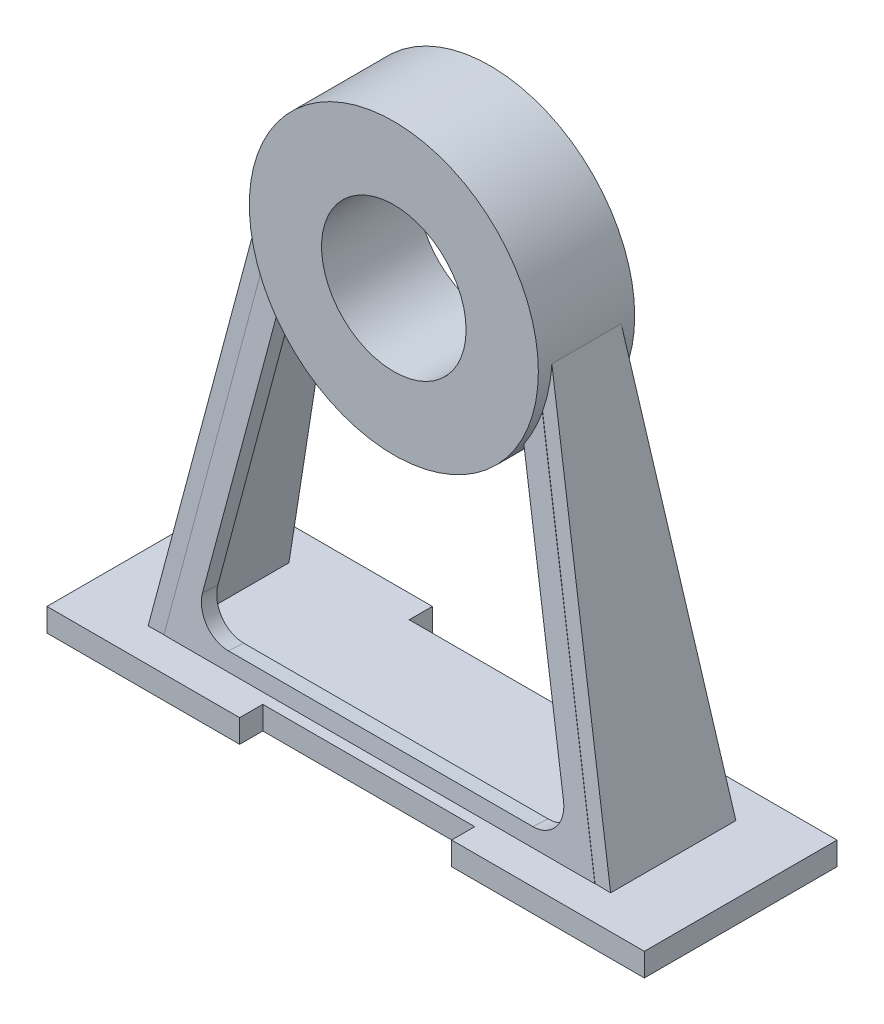
ISO-10303-21;
HEADER;
FILE_DESCRIPTION(('STEP AP214'),'2;1');
FILE_NAME('part.step','',(''),(''),'','','');
FILE_SCHEMA(('AUTOMOTIVE_DESIGN { 1 0 10303 214 1 1 1 1 }'));
ENDSEC;
DATA;
#1=APPLICATION_CONTEXT('core data for automotive mechanical design processes');
#2=APPLICATION_PROTOCOL_DEFINITION('international standard','automotive_design',2000,#1);
#3=PRODUCT_CONTEXT('',#1,'mechanical');
#4=PRODUCT('Part','Part','',(#3));
#5=PRODUCT_RELATED_PRODUCT_CATEGORY('part','',(#4));
#6=PRODUCT_DEFINITION_FORMATION('','',#4);
#7=PRODUCT_DEFINITION_CONTEXT('part definition',#1,'design');
#8=PRODUCT_DEFINITION('design','',#6,#7);
#9=PRODUCT_DEFINITION_SHAPE('','',#8);
#10=(LENGTH_UNIT() NAMED_UNIT(*) SI_UNIT(.MILLI.,.METRE.));
#11=(NAMED_UNIT(*) PLANE_ANGLE_UNIT() SI_UNIT($,.RADIAN.));
#12=(NAMED_UNIT(*) SI_UNIT($,.STERADIAN.) SOLID_ANGLE_UNIT());
#13=UNCERTAINTY_MEASURE_WITH_UNIT(LENGTH_MEASURE(1.E-05),#10,'distance_accuracy_value','');
#14=(GEOMETRIC_REPRESENTATION_CONTEXT(3) GLOBAL_UNCERTAINTY_ASSIGNED_CONTEXT((#13)) GLOBAL_UNIT_ASSIGNED_CONTEXT((#10,
#11,#12)) REPRESENTATION_CONTEXT('',''));
#15=CARTESIAN_POINT('',(0.,0.,0.));
#16=DIRECTION('',(0.,0.,1.));
#17=DIRECTION('',(1.,0.,0.));
#18=AXIS2_PLACEMENT_3D('',#15,#16,#17);
#19=CARTESIAN_POINT('',(43.1850816813382,11.4518389501508,24.5187979151902));
#20=DIRECTION('',(0.,0.997578971240326,-0.069542764822042));
#21=DIRECTION('',(0.,0.069542764822042,0.997578971240326));
#22=AXIS2_PLACEMENT_3D('',#19,#20,#21);
#23=PLANE('',#22);
#24=DIRECTION('',(-1.,0.,0.));
#25=VECTOR('',#24,1.);
#26=CARTESIAN_POINT('',(43.1850816813382,12.0081810687271,32.4994296851128));
#27=LINE('',#26,#25);
#28=CARTESIAN_POINT('',(266.814918318662,12.0081810687271,32.4994296851128));
#29=VERTEX_POINT('',#28);
#30=CARTESIAN_POINT('',(43.1850816813382,12.0081810687271,32.4994296851128));
#31=VERTEX_POINT('',#30);
#32=EDGE_CURVE('E230',#29,#31,#27,.T.);
#33=ORIENTED_EDGE('',*,*,#32,.T.);
#34=DIRECTION('',(0.,0.069542764822042,0.997578971240326));
#35=VECTOR('',#34,1.);
#36=CARTESIAN_POINT('',(43.1850816813382,11.4518389501508,24.5187979151902));
#37=LINE('',#36,#35);
#38=CARTESIAN_POINT('',(43.1850816813382,11.4518389501508,24.5187979151902));
#39=VERTEX_POINT('',#38);
#40=EDGE_CURVE('E12',#39,#31,#37,.T.);
#41=ORIENTED_EDGE('',*,*,#40,.F.);
#42=DIRECTION('',(-1.,0.,0.));
#43=VECTOR('',#42,1.);
#44=CARTESIAN_POINT('',(43.1850816813382,11.4518389501508,24.5187979151902));
#45=LINE('',#44,#43);
#46=CARTESIAN_POINT('',(266.814918318662,11.4518389501508,24.5187979151902));
#47=VERTEX_POINT('',#46);
#48=EDGE_CURVE('E239',#47,#39,#45,.T.);
#49=ORIENTED_EDGE('',*,*,#48,.F.);
#50=DIRECTION('',(0.,0.069542764822042,0.997578971240326));
#51=VECTOR('',#50,1.);
#52=CARTESIAN_POINT('',(266.814918318662,11.4518389501508,24.5187979151902));
#53=LINE('',#52,#51);
#54=EDGE_CURVE('E149',#47,#29,#53,.T.);
#55=ORIENTED_EDGE('',*,*,#54,.T.);
#56=EDGE_LOOP('',(#33,#41,#49,#55));
#57=FACE_BOUND('',#56,.T.);
#58=ADVANCED_FACE('F45',(#57),#23,.F.);
#59=CARTESIAN_POINT('',(83.3241816228875,196.983678679979,11.5850879340243));
#60=DIRECTION('',(0.977493617306712,-0.21045424033746,0.0146710888696787));
#61=DIRECTION('',(0.21047689316903,0.977598832569839,0.));
#62=AXIS2_PLACEMENT_3D('',#59,#60,#61);
#63=PLANE('',#62);
#64=DIRECTION('',(0.210964992651955,0.975127077146814,-0.0679776087434077));
#65=VECTOR('',#64,1.);
#66=CARTESIAN_POINT('',(83.3241816228875,197.540020798555,19.5657197039469));
#67=LINE('',#66,#65);
#68=CARTESIAN_POINT('',(83.3241816228875,197.540020798555,19.5657197039469));
#69=VERTEX_POINT('',#68);
#70=EDGE_CURVE('E224',#31,#69,#67,.T.);
#71=ORIENTED_EDGE('',*,*,#70,.T.);
#72=DIRECTION('',(0.,0.069542764822042,0.997578971240326));
#73=VECTOR('',#72,1.);
#74=CARTESIAN_POINT('',(83.3241816228875,196.983678679979,11.5850879340243));
#75=LINE('',#74,#73);
#76=CARTESIAN_POINT('',(83.3241816228875,196.983678679979,11.5850879340243));
#77=VERTEX_POINT('',#76);
#78=EDGE_CURVE('E53',#77,#69,#75,.T.);
#79=ORIENTED_EDGE('',*,*,#78,.F.);
#80=DIRECTION('',(0.210964992651955,0.975127077146814,-0.0679776087434077));
#81=VECTOR('',#80,1.);
#82=CARTESIAN_POINT('',(83.3241816228875,196.983678679979,11.5850879340243));
#83=LINE('',#82,#81);
#84=EDGE_CURVE('E110',#39,#77,#83,.T.);
#85=ORIENTED_EDGE('',*,*,#84,.F.);
#86=ORIENTED_EDGE('',*,*,#40,.T.);
#87=EDGE_LOOP('',(#71,#79,#85,#86));
#88=FACE_BOUND('',#87,.T.);
#89=ADVANCED_FACE('F181',(#88),#63,.F.);
#90=CARTESIAN_POINT('',(155.,218.958037082905,10.053221603051));
#91=DIRECTION('',(0.,0.069542764822042,0.997578971240326));
#92=DIRECTION('',(1.,0.,0.));
#93=AXIS2_PLACEMENT_3D('',#90,#91,#92);
#94=ELLIPSE('',#93,75.,74.8184228430244);
#95=DIRECTION('',(0.,0.069542764822042,0.997578971240326));
#96=VECTOR('',#95,1.);
#97=SURFACE_OF_LINEAR_EXTRUSION('',#94,#96);
#98=CARTESIAN_POINT('',(155.,219.514379201481,18.0338533729737));
#99=DIRECTION('',(0.,0.069542764822042,0.997578971240326));
#100=DIRECTION('',(1.,0.,0.));
#101=AXIS2_PLACEMENT_3D('',#98,#99,#100);
#102=ELLIPSE('',#101,75.,74.8184228430244);
#103=CARTESIAN_POINT('',(91.6954802114397,179.490259639423,20.8239963232133));
#104=VERTEX_POINT('',#103);
#105=EDGE_CURVE('E219',#69,#104,#102,.T.);
#106=ORIENTED_EDGE('',*,*,#105,.T.);
#107=DIRECTION('',(0.,0.069542764822042,0.997578971240326));
#108=VECTOR('',#107,1.);
#109=CARTESIAN_POINT('',(91.6954802114397,178.933917520847,12.8433645532907));
#110=LINE('',#109,#108);
#111=CARTESIAN_POINT('',(91.6954802114397,178.933917520847,12.8433645532907));
#112=VERTEX_POINT('',#111);
#113=EDGE_CURVE('E213',#112,#104,#110,.T.);
#114=ORIENTED_EDGE('',*,*,#113,.F.);
#115=EDGE_CURVE('E183',#77,#112,#94,.T.);
#116=ORIENTED_EDGE('',*,*,#115,.F.);
#117=ORIENTED_EDGE('',*,*,#78,.T.);
#118=EDGE_LOOP('',(#106,#114,#116,#117));
#119=FACE_BOUND('',#118,.T.);
#120=ADVANCED_FACE('F177',(#119),#97,.F.);
#121=CARTESIAN_POINT('',(91.6954802114397,178.933917520847,12.8433645532907));
#122=DIRECTION('',(-0.977493617306712,0.21045424033746,-0.0146710888696787));
#123=DIRECTION('',(-0.21047689316903,-0.977598832569839,0.));
#124=AXIS2_PLACEMENT_3D('',#121,#122,#123);
#125=PLANE('',#124);
#126=DIRECTION('',(-0.210964992651955,-0.975127077146814,0.0679776087434077));
#127=VECTOR('',#126,1.);
#128=CARTESIAN_POINT('',(91.6954802114397,179.490259639423,20.8239963232133));
#129=LINE('',#128,#127);
#130=CARTESIAN_POINT('',(61.3240781224301,39.1068899835568,30.6103369963386));
#131=VERTEX_POINT('',#130);
#132=EDGE_CURVE('E226',#104,#131,#129,.T.);
#133=ORIENTED_EDGE('',*,*,#132,.T.);
#134=DIRECTION('',(0.,0.069542764822042,0.997578971240326));
#135=VECTOR('',#134,1.);
#136=CARTESIAN_POINT('',(61.3240781224301,38.5505478649805,22.629705226416));
#137=LINE('',#136,#135);
#138=CARTESIAN_POINT('',(61.3240781224301,38.5505478649805,22.629705226416));
#139=VERTEX_POINT('',#138);
#140=EDGE_CURVE('E210',#139,#131,#137,.T.);
#141=ORIENTED_EDGE('',*,*,#140,.F.);
#142=DIRECTION('',(-0.210964992651955,-0.975127077146814,0.0679776087434077));
#143=VECTOR('',#142,1.);
#144=CARTESIAN_POINT('',(91.6954802114397,178.933917520847,12.8433645532907));
#145=LINE('',#144,#143);
#146=EDGE_CURVE('E187',#112,#139,#145,.T.);
#147=ORIENTED_EDGE('',*,*,#146,.F.);
#148=ORIENTED_EDGE('',*,*,#113,.T.);
#149=EDGE_LOOP('',(#133,#141,#147,#148));
#150=FACE_BOUND('',#149,.T.);
#151=ADVANCED_FACE('F173',(#150),#125,.F.);
#152=CARTESIAN_POINT('',(75.9864823820308,35.3937342599186,22.8497715594612));
#153=DIRECTION('',(0.,0.069542764822042,0.997578971240326));
#154=DIRECTION('',(0.,-0.997578971240326,0.069542764822042));
#155=AXIS2_PLACEMENT_3D('',#152,#153,#154);
#156=CYLINDRICAL_SURFACE('',#155,15.);
#157=CARTESIAN_POINT('',(75.9864823820308,35.9500763784949,30.8304033293838));
#158=DIRECTION('',(0.,0.069542764822042,0.997578971240326));
#159=DIRECTION('',(0.,0.997578971240325,-0.0695427648220419));
#160=AXIS2_PLACEMENT_3D('',#157,#158,#159);
#161=CIRCLE('',#160,15.);
#162=CARTESIAN_POINT('',(75.9864823820308,20.98639180989,31.8735448017144));
#163=VERTEX_POINT('',#162);
#164=EDGE_CURVE('E228',#131,#163,#161,.T.);
#165=ORIENTED_EDGE('',*,*,#164,.T.);
#166=DIRECTION('',(0.,0.069542764822042,0.997578971240326));
#167=VECTOR('',#166,1.);
#168=CARTESIAN_POINT('',(75.9864823820308,20.4300496913137,23.8929130317918));
#169=LINE('',#168,#167);
#170=CARTESIAN_POINT('',(75.9864823820308,20.4300496913137,23.8929130317918));
#171=VERTEX_POINT('',#170);
#172=EDGE_CURVE('E203',#171,#163,#169,.T.);
#173=ORIENTED_EDGE('',*,*,#172,.F.);
#174=CARTESIAN_POINT('',(75.9864823820308,35.3937342599186,22.8497715594612));
#175=DIRECTION('',(0.,0.069542764822042,0.997578971240326));
#176=DIRECTION('',(0.,0.997578971240325,-0.0695427648220419));
#177=AXIS2_PLACEMENT_3D('',#174,#175,#176);
#178=CIRCLE('',#177,15.);
#179=EDGE_CURVE('E190',#139,#171,#178,.T.);
#180=ORIENTED_EDGE('',*,*,#179,.F.);
#181=ORIENTED_EDGE('',*,*,#140,.T.);
#182=EDGE_LOOP('',(#165,#173,#180,#181));
#183=FACE_BOUND('',#182,.T.);
#184=ADVANCED_FACE('F169',(#183),#156,.F.);
#185=CARTESIAN_POINT('',(75.9864823820308,20.4300496913137,23.8929130317918));
#186=DIRECTION('',(0.,-0.997578971240326,0.069542764822042));
#187=DIRECTION('',(0.,-0.069542764822042,-0.997578971240326));
#188=AXIS2_PLACEMENT_3D('',#185,#186,#187);
#189=PLANE('',#188);
#190=DIRECTION('',(1.,0.,0.));
#191=VECTOR('',#190,1.);
#192=CARTESIAN_POINT('',(75.9864823820308,20.98639180989,31.8735448017144));
#193=LINE('',#192,#191);
#194=CARTESIAN_POINT('',(234.013517617969,20.98639180989,31.8735448017144));
#195=VERTEX_POINT('',#194);
#196=EDGE_CURVE('E201',#163,#195,#193,.T.);
#197=ORIENTED_EDGE('',*,*,#196,.T.);
#198=DIRECTION('',(0.,0.069542764822042,0.997578971240326));
#199=VECTOR('',#198,1.);
#200=CARTESIAN_POINT('',(234.013517617969,20.4300496913137,23.8929130317918));
#201=LINE('',#200,#199);
#202=CARTESIAN_POINT('',(234.013517617969,20.4300496913137,23.8929130317918));
#203=VERTEX_POINT('',#202);
#204=EDGE_CURVE('E199',#203,#195,#201,.T.);
#205=ORIENTED_EDGE('',*,*,#204,.F.);
#206=DIRECTION('',(1.,0.,0.));
#207=VECTOR('',#206,1.);
#208=CARTESIAN_POINT('',(75.9864823820308,20.4300496913137,23.8929130317918));
#209=LINE('',#208,#207);
#210=EDGE_CURVE('E192',#171,#203,#209,.T.);
#211=ORIENTED_EDGE('',*,*,#210,.F.);
#212=ORIENTED_EDGE('',*,*,#172,.T.);
#213=EDGE_LOOP('',(#197,#205,#211,#212));
#214=FACE_BOUND('',#213,.T.);
#215=ADVANCED_FACE('F165',(#214),#189,.F.);
#216=CARTESIAN_POINT('',(234.013517617969,35.3937342599185,22.8497715594612));
#217=DIRECTION('',(0.,0.069542764822042,0.997578971240326));
#218=DIRECTION('',(0.,-0.997578971240326,0.069542764822042));
#219=AXIS2_PLACEMENT_3D('',#216,#217,#218);
#220=CYLINDRICAL_SURFACE('',#219,15.);
#221=CARTESIAN_POINT('',(234.013517617969,35.9500763784949,30.8304033293838));
#222=DIRECTION('',(0.,0.069542764822042,0.997578971240326));
#223=DIRECTION('',(0.,-0.997578971240325,0.0695427648220419));
#224=AXIS2_PLACEMENT_3D('',#221,#222,#223);
#225=CIRCLE('',#224,15.);
#226=CARTESIAN_POINT('',(248.67592187757,39.1068899835568,30.6103369963386));
#227=VERTEX_POINT('',#226);
#228=EDGE_CURVE('E205',#195,#227,#225,.T.);
#229=ORIENTED_EDGE('',*,*,#228,.T.);
#230=DIRECTION('',(0.,0.069542764822042,0.997578971240326));
#231=VECTOR('',#230,1.);
#232=CARTESIAN_POINT('',(248.67592187757,38.5505478649804,22.629705226416));
#233=LINE('',#232,#231);
#234=CARTESIAN_POINT('',(248.67592187757,38.5505478649804,22.629705226416));
#235=VERTEX_POINT('',#234);
#236=EDGE_CURVE('E144',#235,#227,#233,.T.);
#237=ORIENTED_EDGE('',*,*,#236,.F.);
#238=CARTESIAN_POINT('',(234.013517617969,35.3937342599185,22.8497715594612));
#239=DIRECTION('',(0.,0.069542764822042,0.997578971240326));
#240=DIRECTION('',(0.,-0.997578971240325,0.0695427648220419));
#241=AXIS2_PLACEMENT_3D('',#238,#239,#240);
#242=CIRCLE('',#241,15.);
#243=EDGE_CURVE('E135',#203,#235,#242,.T.);
#244=ORIENTED_EDGE('',*,*,#243,.F.);
#245=ORIENTED_EDGE('',*,*,#204,.T.);
#246=EDGE_LOOP('',(#229,#237,#244,#245));
#247=FACE_BOUND('',#246,.T.);
#248=ADVANCED_FACE('F162',(#247),#220,.F.);
#249=CARTESIAN_POINT('',(218.30451978856,178.933917520847,12.8433645532907));
#250=DIRECTION('',(0.977493617306712,0.210454240337461,-0.0146710888696787));
#251=DIRECTION('',(-0.21047689316903,0.977598832569839,0.));
#252=AXIS2_PLACEMENT_3D('',#249,#250,#251);
#253=PLANE('',#252);
#254=DIRECTION('',(-0.210964992651955,0.975127077146814,-0.0679776087434077));
#255=VECTOR('',#254,1.);
#256=CARTESIAN_POINT('',(218.30451978856,179.490259639423,20.8239963232133));
#257=LINE('',#256,#255);
#258=CARTESIAN_POINT('',(218.30451978856,179.490259639423,20.8239963232133));
#259=VERTEX_POINT('',#258);
#260=EDGE_CURVE('E143',#227,#259,#257,.T.);
#261=ORIENTED_EDGE('',*,*,#260,.T.);
#262=DIRECTION('',(0.,0.069542764822042,0.997578971240326));
#263=VECTOR('',#262,1.);
#264=CARTESIAN_POINT('',(218.30451978856,178.933917520847,12.8433645532907));
#265=LINE('',#264,#263);
#266=CARTESIAN_POINT('',(218.30451978856,178.933917520847,12.8433645532907));
#267=VERTEX_POINT('',#266);
#268=EDGE_CURVE('E140',#267,#259,#265,.T.);
#269=ORIENTED_EDGE('',*,*,#268,.F.);
#270=DIRECTION('',(-0.210964992651955,0.975127077146814,-0.0679776087434077));
#271=VECTOR('',#270,1.);
#272=CARTESIAN_POINT('',(218.30451978856,178.933917520847,12.8433645532907));
#273=LINE('',#272,#271);
#274=EDGE_CURVE('E129',#235,#267,#273,.T.);
#275=ORIENTED_EDGE('',*,*,#274,.F.);
#276=ORIENTED_EDGE('',*,*,#236,.T.);
#277=EDGE_LOOP('',(#261,#269,#275,#276));
#278=FACE_BOUND('',#277,.T.);
#279=ADVANCED_FACE('F141',(#278),#253,.F.);
#280=CARTESIAN_POINT('',(155.,218.958037082905,10.053221603051));
#281=DIRECTION('',(0.,0.069542764822042,0.997578971240326));
#282=DIRECTION('',(1.,0.,0.));
#283=AXIS2_PLACEMENT_3D('',#280,#281,#282);
#284=ELLIPSE('',#283,75.,74.8184228430244);
#285=DIRECTION('',(0.,0.069542764822042,0.997578971240326));
#286=VECTOR('',#285,1.);
#287=SURFACE_OF_LINEAR_EXTRUSION('',#284,#286);
#288=CARTESIAN_POINT('',(155.,219.514379201481,18.0338533729737));
#289=DIRECTION('',(0.,0.069542764822042,0.997578971240326));
#290=DIRECTION('',(1.,0.,0.));
#291=AXIS2_PLACEMENT_3D('',#288,#289,#290);
#292=ELLIPSE('',#291,75.,74.8184228430244);
#293=CARTESIAN_POINT('',(226.675818377113,197.540020798555,19.5657197039469));
#294=VERTEX_POINT('',#293);
#295=EDGE_CURVE('E96',#259,#294,#292,.T.);
#296=ORIENTED_EDGE('',*,*,#295,.T.);
#297=DIRECTION('',(0.,0.069542764822042,0.997578971240326));
#298=VECTOR('',#297,1.);
#299=CARTESIAN_POINT('',(226.675818377113,196.983678679979,11.5850879340243));
#300=LINE('',#299,#298);
#301=CARTESIAN_POINT('',(226.675818377113,196.983678679979,11.5850879340243));
#302=VERTEX_POINT('',#301);
#303=EDGE_CURVE('E145',#302,#294,#300,.T.);
#304=ORIENTED_EDGE('',*,*,#303,.F.);
#305=EDGE_CURVE('E133',#267,#302,#284,.T.);
#306=ORIENTED_EDGE('',*,*,#305,.F.);
#307=ORIENTED_EDGE('',*,*,#268,.T.);
#308=EDGE_LOOP('',(#296,#304,#306,#307));
#309=FACE_BOUND('',#308,.T.);
#310=ADVANCED_FACE('F147',(#309),#287,.F.);
#311=CARTESIAN_POINT('',(226.675818377113,196.983678679979,11.5850879340243));
#312=DIRECTION('',(-0.977493617306712,-0.21045424033746,0.0146710888696787));
#313=DIRECTION('',(0.21047689316903,-0.977598832569839,0.));
#314=AXIS2_PLACEMENT_3D('',#311,#312,#313);
#315=PLANE('',#314);
#316=DIRECTION('',(0.210964992651955,-0.975127077146814,0.0679776087434077));
#317=VECTOR('',#316,1.);
#318=CARTESIAN_POINT('',(226.675818377113,197.540020798555,19.5657197039469));
#319=LINE('',#318,#317);
#320=EDGE_CURVE('E102',#294,#29,#319,.T.);
#321=ORIENTED_EDGE('',*,*,#320,.T.);
#322=ORIENTED_EDGE('',*,*,#54,.F.);
#323=DIRECTION('',(0.210964992651955,-0.975127077146814,0.0679776087434077));
#324=VECTOR('',#323,1.);
#325=CARTESIAN_POINT('',(226.675818377113,196.983678679979,11.5850879340243));
#326=LINE('',#325,#324);
#327=EDGE_CURVE('E61',#302,#47,#326,.T.);
#328=ORIENTED_EDGE('',*,*,#327,.F.);
#329=ORIENTED_EDGE('',*,*,#303,.T.);
#330=EDGE_LOOP('',(#321,#322,#328,#329));
#331=FACE_BOUND('',#330,.T.);
#332=ADVANCED_FACE('F158',(#331),#315,.F.);
#333=CARTESIAN_POINT('',(155.,218.958037082905,10.053221603051));
#334=DIRECTION('',(0.,-0.069542764822042,-0.997578971240326));
#335=DIRECTION('',(0.,0.997578971240325,-0.0695427648220419));
#336=AXIS2_PLACEMENT_3D('',#333,#334,#335);
#337=PLANE('',#336);
#338=ORIENTED_EDGE('',*,*,#48,.T.);
#339=ORIENTED_EDGE('',*,*,#84,.T.);
#340=ORIENTED_EDGE('',*,*,#115,.T.);
#341=ORIENTED_EDGE('',*,*,#146,.T.);
#342=ORIENTED_EDGE('',*,*,#179,.T.);
#343=ORIENTED_EDGE('',*,*,#210,.T.);
#344=ORIENTED_EDGE('',*,*,#243,.T.);
#345=ORIENTED_EDGE('',*,*,#274,.T.);
#346=ORIENTED_EDGE('',*,*,#305,.T.);
#347=ORIENTED_EDGE('',*,*,#327,.T.);
#348=EDGE_LOOP('',(#338,#339,#340,#341,#342,#343,#344,#345,#346,#347));
#349=FACE_BOUND('',#348,.T.);
#350=ADVANCED_FACE('F131',(#349),#337,.T.);
#351=CARTESIAN_POINT('',(155.,219.514379201481,18.0338533729737));
#352=DIRECTION('',(0.,-0.069542764822042,-0.997578971240326));
#353=DIRECTION('',(0.,0.997578971240325,-0.0695427648220419));
#354=AXIS2_PLACEMENT_3D('',#351,#352,#353);
#355=PLANE('',#354);
#356=ORIENTED_EDGE('',*,*,#32,.F.);
#357=ORIENTED_EDGE('',*,*,#320,.F.);
#358=ORIENTED_EDGE('',*,*,#295,.F.);
#359=ORIENTED_EDGE('',*,*,#260,.F.);
#360=ORIENTED_EDGE('',*,*,#228,.F.);
#361=ORIENTED_EDGE('',*,*,#196,.F.);
#362=ORIENTED_EDGE('',*,*,#164,.F.);
#363=ORIENTED_EDGE('',*,*,#132,.F.);
#364=ORIENTED_EDGE('',*,*,#105,.F.);
#365=ORIENTED_EDGE('',*,*,#70,.F.);
#366=EDGE_LOOP('',(#356,#357,#358,#359,#360,#361,#362,#363,#364,#365));
#367=FACE_BOUND('',#366,.T.);
#368=ADVANCED_FACE('F223',(#367),#355,.F.);
#369=CLOSED_SHELL('',(#58,#89,#120,#151,#184,#215,#248,#279,#310,#332,#350,#368));
#370=MANIFOLD_SOLID_BREP('B2',#369);
#371=CARTESIAN_POINT('',(155.,220.,25.));
#372=DIRECTION('',(0.,0.,-1.));
#373=DIRECTION('',(-1.,0.,0.));
#374=AXIS2_PLACEMENT_3D('',#371,#372,#373);
#375=CYLINDRICAL_SURFACE('',#374,75.);
#376=CARTESIAN_POINT('',(155.,220.,16.9194395990196));
#377=DIRECTION('',(-0.0143741453261985,-0.0664404939522062,-0.997686847016401));
#378=DIRECTION('',(0.210964992651955,0.975127077146814,-0.0679776087434077));
#379=AXIS2_PLACEMENT_3D('',#376,#377,#378);
#380=ELLIPSE('',#379,75.1738887049466,75.);
#381=CARTESIAN_POINT('',(80.,220.,18.));
#382=VERTEX_POINT('',#381);
#383=CARTESIAN_POINT('',(83.3734483682194,197.759561574918,19.432488843423));
#384=VERTEX_POINT('',#383);
#385=EDGE_CURVE('E493',#382,#384,#380,.F.);
#386=ORIENTED_EDGE('',*,*,#385,.T.);
#387=DIRECTION('',(0.,0.,-1.));
#388=VECTOR('',#387,1.);
#389=CARTESIAN_POINT('',(83.3734483682194,197.759561574918,25.));
#390=LINE('',#389,#388);
#391=CARTESIAN_POINT('',(83.3734483682194,197.759561574918,-19.432488843423));
#392=VERTEX_POINT('',#391);
#393=EDGE_CURVE('E501',#384,#392,#390,.T.);
#394=ORIENTED_EDGE('',*,*,#393,.T.);
#395=CARTESIAN_POINT('',(155.,220.,-16.9194395990196));
#396=DIRECTION('',(-0.0143741453261985,-0.0664404939522062,0.997686847016401));
#397=DIRECTION('',(-0.210964992651955,-0.975127077146814,-0.0679776087434077));
#398=AXIS2_PLACEMENT_3D('',#395,#396,#397);
#399=ELLIPSE('',#398,75.1738887049466,75.);
#400=CARTESIAN_POINT('',(80.,220.,-18.));
#401=VERTEX_POINT('',#400);
#402=EDGE_CURVE('E498',#392,#401,#399,.F.);
#403=ORIENTED_EDGE('',*,*,#402,.T.);
#404=DIRECTION('',(0.,0.,1.));
#405=VECTOR('',#404,1.);
#406=CARTESIAN_POINT('',(80.,220.,-18.));
#407=LINE('',#406,#405);
#408=EDGE_CURVE('E514',#401,#382,#407,.T.);
#409=ORIENTED_EDGE('',*,*,#408,.T.);
#410=EDGE_LOOP('',(#386,#394,#403,#409));
#411=FACE_BOUND('',#410,.T.);
#412=CARTESIAN_POINT('',(155.,220.,-25.));
#413=DIRECTION('',(0.,0.,1.));
#414=DIRECTION('',(1.,0.,0.));
#415=AXIS2_PLACEMENT_3D('',#412,#413,#414);
#416=CIRCLE('',#415,75.);
#417=CARTESIAN_POINT('',(230.,220.,-25.));
#418=VERTEX_POINT('',#417);
#419=EDGE_CURVE('E488',#418,#418,#416,.T.);
#420=ORIENTED_EDGE('',*,*,#419,.T.);
#421=EDGE_LOOP('',(#420));
#422=FACE_BOUND('',#421,.T.);
#423=CARTESIAN_POINT('',(155.,220.,25.));
#424=DIRECTION('',(0.,0.,1.));
#425=DIRECTION('',(1.,0.,0.));
#426=AXIS2_PLACEMENT_3D('',#423,#424,#425);
#427=CIRCLE('',#426,75.);
#428=CARTESIAN_POINT('',(230.,220.,25.));
#429=VERTEX_POINT('',#428);
#430=EDGE_CURVE('E490',#429,#429,#427,.T.);
#431=ORIENTED_EDGE('',*,*,#430,.F.);
#432=EDGE_LOOP('',(#431));
#433=FACE_BOUND('',#432,.T.);
#434=DIRECTION('',(0.,0.,-1.));
#435=VECTOR('',#434,1.);
#436=CARTESIAN_POINT('',(226.626551631781,197.759561574918,25.));
#437=LINE('',#436,#435);
#438=CARTESIAN_POINT('',(226.626551631781,197.759561574918,19.432488843423));
#439=VERTEX_POINT('',#438);
#440=CARTESIAN_POINT('',(226.626551631781,197.759561574918,-19.432488843423));
#441=VERTEX_POINT('',#440);
#442=EDGE_CURVE('E43',#439,#441,#437,.T.);
#443=ORIENTED_EDGE('',*,*,#442,.F.);
#444=CARTESIAN_POINT('',(155.,220.,16.9194395990196));
#445=DIRECTION('',(-0.0143741453261985,0.0664404939522062,0.997686847016401));
#446=DIRECTION('',(-0.210964992651955,0.975127077146814,-0.0679776087434077));
#447=AXIS2_PLACEMENT_3D('',#444,#445,#446);
#448=ELLIPSE('',#447,75.1738887049466,75.);
#449=CARTESIAN_POINT('',(230.,220.,18.));
#450=VERTEX_POINT('',#449);
#451=EDGE_CURVE('E614',#439,#450,#448,.T.);
#452=ORIENTED_EDGE('',*,*,#451,.T.);
#453=DIRECTION('',(0.,0.,1.));
#454=VECTOR('',#453,1.);
#455=CARTESIAN_POINT('',(230.,220.,-18.));
#456=LINE('',#455,#454);
#457=CARTESIAN_POINT('',(230.,220.,-18.));
#458=VERTEX_POINT('',#457);
#459=EDGE_CURVE('E618',#458,#450,#456,.T.);
#460=ORIENTED_EDGE('',*,*,#459,.F.);
#461=CARTESIAN_POINT('',(155.,220.,-16.9194395990196));
#462=DIRECTION('',(-0.0143741453261985,0.0664404939522062,-0.997686847016401));
#463=DIRECTION('',(0.210964992651955,-0.975127077146814,-0.0679776087434077));
#464=AXIS2_PLACEMENT_3D('',#461,#462,#463);
#465=ELLIPSE('',#464,75.1738887049466,75.);
#466=EDGE_CURVE('E335',#458,#441,#465,.T.);
#467=ORIENTED_EDGE('',*,*,#466,.T.);
#468=EDGE_LOOP('',(#443,#452,#460,#467));
#469=FACE_BOUND('',#468,.T.);
#470=ADVANCED_FACE('F327',(#411,#422,#433,#469),#375,.T.);
#471=CARTESIAN_POINT('',(38.7740814295174,-8.38862338619367,0.));
#472=DIRECTION('',(-0.977387924941526,0.211454118376772,0.));
#473=DIRECTION('',(-0.211454118376772,-0.977387924941526,0.));
#474=AXIS2_PLACEMENT_3D('',#471,#472,#473);
#475=PLANE('',#474);
#476=ORIENTED_EDGE('',*,*,#393,.F.);
#477=DIRECTION('',(-0.210964992651955,-0.975127077146814,0.0679776087434077));
#478=VECTOR('',#477,1.);
#479=CARTESIAN_POINT('',(87.8191033995322,218.308367052986,18.));
#480=LINE('',#479,#478);
#481=CARTESIAN_POINT('',(43.1850816813382,12.,32.3820736647514));
#482=VERTEX_POINT('',#481);
#483=EDGE_CURVE('E508',#384,#482,#480,.T.);
#484=ORIENTED_EDGE('',*,*,#483,.T.);
#485=DIRECTION('',(0.,0.,-1.));
#486=VECTOR('',#485,1.);
#487=CARTESIAN_POINT('',(43.1850816813382,12.,0.));
#488=LINE('',#487,#486);
#489=CARTESIAN_POINT('',(43.1850816813382,12.,-32.3820736647514));
#490=VERTEX_POINT('',#489);
#491=EDGE_CURVE('E612',#482,#490,#488,.T.);
#492=ORIENTED_EDGE('',*,*,#491,.T.);
#493=DIRECTION('',(0.210964992651955,0.975127077146814,0.0679776087434077));
#494=VECTOR('',#493,1.);
#495=CARTESIAN_POINT('',(87.8191033995322,218.308367052986,-18.));
#496=LINE('',#495,#494);
#497=EDGE_CURVE('E505',#490,#392,#496,.T.);
#498=ORIENTED_EDGE('',*,*,#497,.T.);
#499=EDGE_LOOP('',(#476,#484,#492,#498));
#500=FACE_BOUND('',#499,.T.);
#501=ADVANCED_FACE('F644',(#500),#475,.F.);
#502=CARTESIAN_POINT('',(0.,12.,0.));
#503=DIRECTION('',(0.,-1.,0.));
#504=DIRECTION('',(0.,0.,-1.));
#505=AXIS2_PLACEMENT_3D('',#502,#503,#504);
#506=PLANE('',#505);
#507=DIRECTION('',(0.,0.,1.));
#508=VECTOR('',#507,1.);
#509=CARTESIAN_POINT('',(266.814918318662,12.,0.));
#510=LINE('',#509,#508);
#511=CARTESIAN_POINT('',(266.814918318662,12.,-32.3820736647514));
#512=VERTEX_POINT('',#511);
#513=CARTESIAN_POINT('',(266.814918318662,12.,32.3820736647514));
#514=VERTEX_POINT('',#513);
#515=EDGE_CURVE('E477',#512,#514,#510,.T.);
#516=ORIENTED_EDGE('',*,*,#515,.F.);
#517=DIRECTION('',(0.999896228530108,0.,-0.0144059769285234));
#518=VECTOR('',#517,1.);
#519=CARTESIAN_POINT('',(-0.411074317873559,12.,-28.5320226546752));
#520=LINE('',#519,#518);
#521=CARTESIAN_POINT('',(275.,12.,-32.5));
#522=VERTEX_POINT('',#521);
#523=EDGE_CURVE('E463',#512,#522,#520,.T.);
#524=ORIENTED_EDGE('',*,*,#523,.T.);
#525=DIRECTION('',(0.,0.,-1.));
#526=VECTOR('',#525,1.);
#527=CARTESIAN_POINT('',(275.,12.,-32.5));
#528=LINE('',#527,#526);
#529=CARTESIAN_POINT('',(275.,12.,32.5));
#530=VERTEX_POINT('',#529);
#531=EDGE_CURVE('E467',#530,#522,#528,.T.);
#532=ORIENTED_EDGE('',*,*,#531,.F.);
#533=DIRECTION('',(-0.999896228530108,0.,-0.0144059769285234));
#534=VECTOR('',#533,1.);
#535=CARTESIAN_POINT('',(-0.411074317873559,12.,28.5320226546752));
#536=LINE('',#535,#534);
#537=EDGE_CURVE('E479',#530,#514,#536,.T.);
#538=ORIENTED_EDGE('',*,*,#537,.T.);
#539=EDGE_LOOP('',(#516,#524,#532,#538));
#540=FACE_BOUND('',#539,.T.);
#541=DIRECTION('',(-1.,0.,0.));
#542=VECTOR('',#541,1.);
#543=CARTESIAN_POINT('',(0.,12.,-50.));
#544=LINE('',#543,#542);
#545=CARTESIAN_POINT('',(100.,12.,-50.));
#546=VERTEX_POINT('',#545);
#547=CARTESIAN_POINT('',(0.,12.,-50.));
#548=VERTEX_POINT('',#547);
#549=EDGE_CURVE('E521',#546,#548,#544,.T.);
#550=ORIENTED_EDGE('',*,*,#549,.T.);
#551=DIRECTION('',(0.,0.,1.));
#552=VECTOR('',#551,1.);
#553=CARTESIAN_POINT('',(0.,12.,50.));
#554=LINE('',#553,#552);
#555=CARTESIAN_POINT('',(0.,12.,50.));
#556=VERTEX_POINT('',#555);
#557=EDGE_CURVE('E524',#548,#556,#554,.T.);
#558=ORIENTED_EDGE('',*,*,#557,.T.);
#559=DIRECTION('',(1.,0.,0.));
#560=VECTOR('',#559,1.);
#561=CARTESIAN_POINT('',(0.,12.,50.));
#562=LINE('',#561,#560);
#563=CARTESIAN_POINT('',(100.,12.,50.));
#564=VERTEX_POINT('',#563);
#565=EDGE_CURVE('E527',#556,#564,#562,.T.);
#566=ORIENTED_EDGE('',*,*,#565,.T.);
#567=DIRECTION('',(0.,0.,-1.));
#568=VECTOR('',#567,1.);
#569=CARTESIAN_POINT('',(100.,12.,50.));
#570=LINE('',#569,#568);
#571=CARTESIAN_POINT('',(100.,12.,38.));
#572=VERTEX_POINT('',#571);
#573=EDGE_CURVE('E529',#564,#572,#570,.T.);
#574=ORIENTED_EDGE('',*,*,#573,.T.);
#575=DIRECTION('',(1.,0.,0.));
#576=VECTOR('',#575,1.);
#577=CARTESIAN_POINT('',(100.,12.,38.));
#578=LINE('',#577,#576);
#579=CARTESIAN_POINT('',(210.,12.,38.));
#580=VERTEX_POINT('',#579);
#581=EDGE_CURVE('E531',#572,#580,#578,.T.);
#582=ORIENTED_EDGE('',*,*,#581,.T.);
#583=DIRECTION('',(0.,0.,1.));
#584=VECTOR('',#583,1.);
#585=CARTESIAN_POINT('',(210.,12.,38.));
#586=LINE('',#585,#584);
#587=CARTESIAN_POINT('',(210.,12.,50.));
#588=VERTEX_POINT('',#587);
#589=EDGE_CURVE('E533',#580,#588,#586,.T.);
#590=ORIENTED_EDGE('',*,*,#589,.T.);
#591=DIRECTION('',(1.,0.,0.));
#592=VECTOR('',#591,1.);
#593=CARTESIAN_POINT('',(210.,12.,50.));
#594=LINE('',#593,#592);
#595=CARTESIAN_POINT('',(310.,12.,50.));
#596=VERTEX_POINT('',#595);
#597=EDGE_CURVE('E535',#588,#596,#594,.T.);
#598=ORIENTED_EDGE('',*,*,#597,.T.);
#599=DIRECTION('',(0.,0.,-1.));
#600=VECTOR('',#599,1.);
#601=CARTESIAN_POINT('',(310.,12.,-50.));
#602=LINE('',#601,#600);
#603=CARTESIAN_POINT('',(310.,12.,-50.));
#604=VERTEX_POINT('',#603);
#605=EDGE_CURVE('E537',#596,#604,#602,.T.);
#606=ORIENTED_EDGE('',*,*,#605,.T.);
#607=DIRECTION('',(-1.,0.,0.));
#608=VECTOR('',#607,1.);
#609=CARTESIAN_POINT('',(210.,12.,-50.));
#610=LINE('',#609,#608);
#611=CARTESIAN_POINT('',(210.,12.,-50.));
#612=VERTEX_POINT('',#611);
#613=EDGE_CURVE('E539',#604,#612,#610,.T.);
#614=ORIENTED_EDGE('',*,*,#613,.T.);
#615=DIRECTION('',(0.,0.,1.));
#616=VECTOR('',#615,1.);
#617=CARTESIAN_POINT('',(210.,12.,-38.));
#618=LINE('',#617,#616);
#619=CARTESIAN_POINT('',(210.,12.,-38.));
#620=VERTEX_POINT('',#619);
#621=EDGE_CURVE('E541',#612,#620,#618,.T.);
#622=ORIENTED_EDGE('',*,*,#621,.T.);
#623=DIRECTION('',(-1.,0.,0.));
#624=VECTOR('',#623,1.);
#625=CARTESIAN_POINT('',(100.,12.,-38.));
#626=LINE('',#625,#624);
#627=CARTESIAN_POINT('',(100.,12.,-38.));
#628=VERTEX_POINT('',#627);
#629=EDGE_CURVE('E543',#620,#628,#626,.T.);
#630=ORIENTED_EDGE('',*,*,#629,.T.);
#631=DIRECTION('',(0.,0.,-1.));
#632=VECTOR('',#631,1.);
#633=CARTESIAN_POINT('',(100.,12.,-50.));
#634=LINE('',#633,#632);
#635=EDGE_CURVE('E545',#628,#546,#634,.T.);
#636=ORIENTED_EDGE('',*,*,#635,.T.);
#637=EDGE_LOOP('',(#550,#558,#566,#574,#582,#590,#598,#606,#614,#622,#630,#636));
#638=FACE_BOUND('',#637,.T.);
#639=ORIENTED_EDGE('',*,*,#491,.F.);
#640=DIRECTION('',(0.999896228530108,0.,-0.0144059769285234));
#641=VECTOR('',#640,1.);
#642=CARTESIAN_POINT('',(0.475409290965755,12.,32.9974120744032));
#643=LINE('',#642,#641);
#644=CARTESIAN_POINT('',(35.,12.,32.5));
#645=VERTEX_POINT('',#644);
#646=EDGE_CURVE('E606',#645,#482,#643,.T.);
#647=ORIENTED_EDGE('',*,*,#646,.F.);
#648=DIRECTION('',(0.,0.,-1.));
#649=VECTOR('',#648,1.);
#650=CARTESIAN_POINT('',(35.,12.,-32.5));
#651=LINE('',#650,#649);
#652=CARTESIAN_POINT('',(35.,12.,-32.5));
#653=VERTEX_POINT('',#652);
#654=EDGE_CURVE('E509',#645,#653,#651,.T.);
#655=ORIENTED_EDGE('',*,*,#654,.T.);
#656=DIRECTION('',(-0.999896228530108,0.,-0.0144059769285234));
#657=VECTOR('',#656,1.);
#658=CARTESIAN_POINT('',(0.475409290965755,12.,-32.9974120744032));
#659=LINE('',#658,#657);
#660=EDGE_CURVE('E609',#490,#653,#659,.T.);
#661=ORIENTED_EDGE('',*,*,#660,.F.);
#662=EDGE_LOOP('',(#639,#647,#655,#661));
#663=FACE_BOUND('',#662,.T.);
#664=ADVANCED_FACE('F475',(#540,#638,#663),#506,.F.);
#665=CARTESIAN_POINT('',(0.,12.,-50.));
#666=DIRECTION('',(0.,0.,1.));
#667=DIRECTION('',(1.,0.,0.));
#668=AXIS2_PLACEMENT_3D('',#665,#666,#667);
#669=PLANE('',#668);
#670=DIRECTION('',(-1.,0.,0.));
#671=VECTOR('',#670,1.);
#672=CARTESIAN_POINT('',(0.,0.,-50.));
#673=LINE('',#672,#671);
#674=CARTESIAN_POINT('',(100.,0.,-50.));
#675=VERTEX_POINT('',#674);
#676=CARTESIAN_POINT('',(0.,0.,-50.));
#677=VERTEX_POINT('',#676);
#678=EDGE_CURVE('E511',#675,#677,#673,.T.);
#679=ORIENTED_EDGE('',*,*,#678,.T.);
#680=DIRECTION('',(0.,-1.,0.));
#681=VECTOR('',#680,1.);
#682=CARTESIAN_POINT('',(0.,12.,-50.));
#683=LINE('',#682,#681);
#684=EDGE_CURVE('E603',#548,#677,#683,.T.);
#685=ORIENTED_EDGE('',*,*,#684,.F.);
#686=ORIENTED_EDGE('',*,*,#549,.F.);
#687=DIRECTION('',(0.,-1.,0.));
#688=VECTOR('',#687,1.);
#689=CARTESIAN_POINT('',(100.,12.,-50.));
#690=LINE('',#689,#688);
#691=EDGE_CURVE('E547',#546,#675,#690,.T.);
#692=ORIENTED_EDGE('',*,*,#691,.T.);
#693=EDGE_LOOP('',(#679,#685,#686,#692));
#694=FACE_BOUND('',#693,.T.);
#695=ADVANCED_FACE('F329',(#694),#669,.F.);
#696=CARTESIAN_POINT('',(0.,12.,50.));
#697=DIRECTION('',(1.,0.,0.));
#698=DIRECTION('',(0.,0.,-1.));
#699=AXIS2_PLACEMENT_3D('',#696,#697,#698);
#700=PLANE('',#699);
#701=DIRECTION('',(0.,0.,1.));
#702=VECTOR('',#701,1.);
#703=CARTESIAN_POINT('',(0.,0.,50.));
#704=LINE('',#703,#702);
#705=CARTESIAN_POINT('',(0.,0.,50.));
#706=VERTEX_POINT('',#705);
#707=EDGE_CURVE('E550',#677,#706,#704,.T.);
#708=ORIENTED_EDGE('',*,*,#707,.T.);
#709=DIRECTION('',(0.,-1.,0.));
#710=VECTOR('',#709,1.);
#711=CARTESIAN_POINT('',(0.,12.,50.));
#712=LINE('',#711,#710);
#713=EDGE_CURVE('E600',#556,#706,#712,.T.);
#714=ORIENTED_EDGE('',*,*,#713,.F.);
#715=ORIENTED_EDGE('',*,*,#557,.F.);
#716=ORIENTED_EDGE('',*,*,#684,.T.);
#717=EDGE_LOOP('',(#708,#714,#715,#716));
#718=FACE_BOUND('',#717,.T.);
#719=ADVANCED_FACE('F713',(#718),#700,.F.);
#720=CARTESIAN_POINT('',(0.,12.,50.));
#721=DIRECTION('',(0.,0.,-1.));
#722=DIRECTION('',(-1.,0.,0.));
#723=AXIS2_PLACEMENT_3D('',#720,#721,#722);
#724=PLANE('',#723);
#725=DIRECTION('',(1.,0.,0.));
#726=VECTOR('',#725,1.);
#727=CARTESIAN_POINT('',(0.,0.,50.));
#728=LINE('',#727,#726);
#729=CARTESIAN_POINT('',(100.,0.,50.));
#730=VERTEX_POINT('',#729);
#731=EDGE_CURVE('E552',#706,#730,#728,.T.);
#732=ORIENTED_EDGE('',*,*,#731,.T.);
#733=DIRECTION('',(0.,-1.,0.));
#734=VECTOR('',#733,1.);
#735=CARTESIAN_POINT('',(100.,12.,50.));
#736=LINE('',#735,#734);
#737=EDGE_CURVE('E597',#564,#730,#736,.T.);
#738=ORIENTED_EDGE('',*,*,#737,.F.);
#739=ORIENTED_EDGE('',*,*,#565,.F.);
#740=ORIENTED_EDGE('',*,*,#713,.T.);
#741=EDGE_LOOP('',(#732,#738,#739,#740));
#742=FACE_BOUND('',#741,.T.);
#743=ADVANCED_FACE('F710',(#742),#724,.F.);
#744=CARTESIAN_POINT('',(100.,12.,50.));
#745=DIRECTION('',(-1.,0.,0.));
#746=DIRECTION('',(0.,0.,1.));
#747=AXIS2_PLACEMENT_3D('',#744,#745,#746);
#748=PLANE('',#747);
#749=DIRECTION('',(0.,0.,-1.));
#750=VECTOR('',#749,1.);
#751=CARTESIAN_POINT('',(100.,0.,50.));
#752=LINE('',#751,#750);
#753=CARTESIAN_POINT('',(100.,0.,38.));
#754=VERTEX_POINT('',#753);
#755=EDGE_CURVE('E554',#730,#754,#752,.T.);
#756=ORIENTED_EDGE('',*,*,#755,.T.);
#757=DIRECTION('',(0.,-1.,0.));
#758=VECTOR('',#757,1.);
#759=CARTESIAN_POINT('',(100.,12.,38.));
#760=LINE('',#759,#758);
#761=EDGE_CURVE('E594',#572,#754,#760,.T.);
#762=ORIENTED_EDGE('',*,*,#761,.F.);
#763=ORIENTED_EDGE('',*,*,#573,.F.);
#764=ORIENTED_EDGE('',*,*,#737,.T.);
#765=EDGE_LOOP('',(#756,#762,#763,#764));
#766=FACE_BOUND('',#765,.T.);
#767=ADVANCED_FACE('F706',(#766),#748,.F.);
#768=CARTESIAN_POINT('',(100.,12.,38.));
#769=DIRECTION('',(0.,0.,-1.));
#770=DIRECTION('',(-1.,0.,0.));
#771=AXIS2_PLACEMENT_3D('',#768,#769,#770);
#772=PLANE('',#771);
#773=DIRECTION('',(1.,0.,0.));
#774=VECTOR('',#773,1.);
#775=CARTESIAN_POINT('',(100.,0.,38.));
#776=LINE('',#775,#774);
#777=CARTESIAN_POINT('',(210.,0.,38.));
#778=VERTEX_POINT('',#777);
#779=EDGE_CURVE('E556',#754,#778,#776,.T.);
#780=ORIENTED_EDGE('',*,*,#779,.T.);
#781=DIRECTION('',(0.,-1.,0.));
#782=VECTOR('',#781,1.);
#783=CARTESIAN_POINT('',(210.,12.,38.));
#784=LINE('',#783,#782);
#785=EDGE_CURVE('E591',#580,#778,#784,.T.);
#786=ORIENTED_EDGE('',*,*,#785,.F.);
#787=ORIENTED_EDGE('',*,*,#581,.F.);
#788=ORIENTED_EDGE('',*,*,#761,.T.);
#789=EDGE_LOOP('',(#780,#786,#787,#788));
#790=FACE_BOUND('',#789,.T.);
#791=ADVANCED_FACE('F702',(#790),#772,.F.);
#792=CARTESIAN_POINT('',(210.,12.,38.));
#793=DIRECTION('',(1.,0.,0.));
#794=DIRECTION('',(0.,0.,-1.));
#795=AXIS2_PLACEMENT_3D('',#792,#793,#794);
#796=PLANE('',#795);
#797=DIRECTION('',(0.,0.,1.));
#798=VECTOR('',#797,1.);
#799=CARTESIAN_POINT('',(210.,0.,38.));
#800=LINE('',#799,#798);
#801=CARTESIAN_POINT('',(210.,0.,50.));
#802=VERTEX_POINT('',#801);
#803=EDGE_CURVE('E558',#778,#802,#800,.T.);
#804=ORIENTED_EDGE('',*,*,#803,.T.);
#805=DIRECTION('',(0.,-1.,0.));
#806=VECTOR('',#805,1.);
#807=CARTESIAN_POINT('',(210.,12.,50.));
#808=LINE('',#807,#806);
#809=EDGE_CURVE('E588',#588,#802,#808,.T.);
#810=ORIENTED_EDGE('',*,*,#809,.F.);
#811=ORIENTED_EDGE('',*,*,#589,.F.);
#812=ORIENTED_EDGE('',*,*,#785,.T.);
#813=EDGE_LOOP('',(#804,#810,#811,#812));
#814=FACE_BOUND('',#813,.T.);
#815=ADVANCED_FACE('F698',(#814),#796,.F.);
#816=CARTESIAN_POINT('',(210.,12.,50.));
#817=DIRECTION('',(0.,0.,-1.));
#818=DIRECTION('',(-1.,0.,0.));
#819=AXIS2_PLACEMENT_3D('',#816,#817,#818);
#820=PLANE('',#819);
#821=DIRECTION('',(1.,0.,0.));
#822=VECTOR('',#821,1.);
#823=CARTESIAN_POINT('',(210.,0.,50.));
#824=LINE('',#823,#822);
#825=CARTESIAN_POINT('',(310.,0.,50.));
#826=VERTEX_POINT('',#825);
#827=EDGE_CURVE('E560',#802,#826,#824,.T.);
#828=ORIENTED_EDGE('',*,*,#827,.T.);
#829=DIRECTION('',(0.,-1.,0.));
#830=VECTOR('',#829,1.);
#831=CARTESIAN_POINT('',(310.,12.,50.));
#832=LINE('',#831,#830);
#833=EDGE_CURVE('E585',#596,#826,#832,.T.);
#834=ORIENTED_EDGE('',*,*,#833,.F.);
#835=ORIENTED_EDGE('',*,*,#597,.F.);
#836=ORIENTED_EDGE('',*,*,#809,.T.);
#837=EDGE_LOOP('',(#828,#834,#835,#836));
#838=FACE_BOUND('',#837,.T.);
#839=ADVANCED_FACE('F694',(#838),#820,.F.);
#840=CARTESIAN_POINT('',(310.,12.,-50.));
#841=DIRECTION('',(-1.,0.,0.));
#842=DIRECTION('',(0.,0.,1.));
#843=AXIS2_PLACEMENT_3D('',#840,#841,#842);
#844=PLANE('',#843);
#845=DIRECTION('',(0.,0.,-1.));
#846=VECTOR('',#845,1.);
#847=CARTESIAN_POINT('',(310.,0.,-50.));
#848=LINE('',#847,#846);
#849=CARTESIAN_POINT('',(310.,0.,-50.));
#850=VERTEX_POINT('',#849);
#851=EDGE_CURVE('E562',#826,#850,#848,.T.);
#852=ORIENTED_EDGE('',*,*,#851,.T.);
#853=DIRECTION('',(0.,-1.,0.));
#854=VECTOR('',#853,1.);
#855=CARTESIAN_POINT('',(310.,12.,-50.));
#856=LINE('',#855,#854);
#857=EDGE_CURVE('E582',#604,#850,#856,.T.);
#858=ORIENTED_EDGE('',*,*,#857,.F.);
#859=ORIENTED_EDGE('',*,*,#605,.F.);
#860=ORIENTED_EDGE('',*,*,#833,.T.);
#861=EDGE_LOOP('',(#852,#858,#859,#860));
#862=FACE_BOUND('',#861,.T.);
#863=ADVANCED_FACE('F690',(#862),#844,.F.);
#864=CARTESIAN_POINT('',(210.,12.,-50.));
#865=DIRECTION('',(0.,0.,1.));
#866=DIRECTION('',(1.,0.,0.));
#867=AXIS2_PLACEMENT_3D('',#864,#865,#866);
#868=PLANE('',#867);
#869=DIRECTION('',(-1.,0.,0.));
#870=VECTOR('',#869,1.);
#871=CARTESIAN_POINT('',(210.,0.,-50.));
#872=LINE('',#871,#870);
#873=CARTESIAN_POINT('',(210.,0.,-50.));
#874=VERTEX_POINT('',#873);
#875=EDGE_CURVE('E564',#850,#874,#872,.T.);
#876=ORIENTED_EDGE('',*,*,#875,.T.);
#877=DIRECTION('',(0.,-1.,0.));
#878=VECTOR('',#877,1.);
#879=CARTESIAN_POINT('',(210.,12.,-50.));
#880=LINE('',#879,#878);
#881=EDGE_CURVE('E579',#612,#874,#880,.T.);
#882=ORIENTED_EDGE('',*,*,#881,.F.);
#883=ORIENTED_EDGE('',*,*,#613,.F.);
#884=ORIENTED_EDGE('',*,*,#857,.T.);
#885=EDGE_LOOP('',(#876,#882,#883,#884));
#886=FACE_BOUND('',#885,.T.);
#887=ADVANCED_FACE('F686',(#886),#868,.F.);
#888=CARTESIAN_POINT('',(210.,12.,-38.));
#889=DIRECTION('',(1.,0.,0.));
#890=DIRECTION('',(0.,0.,-1.));
#891=AXIS2_PLACEMENT_3D('',#888,#889,#890);
#892=PLANE('',#891);
#893=DIRECTION('',(0.,0.,1.));
#894=VECTOR('',#893,1.);
#895=CARTESIAN_POINT('',(210.,0.,-38.));
#896=LINE('',#895,#894);
#897=CARTESIAN_POINT('',(210.,0.,-38.));
#898=VERTEX_POINT('',#897);
#899=EDGE_CURVE('E566',#874,#898,#896,.T.);
#900=ORIENTED_EDGE('',*,*,#899,.T.);
#901=DIRECTION('',(0.,-1.,0.));
#902=VECTOR('',#901,1.);
#903=CARTESIAN_POINT('',(210.,12.,-38.));
#904=LINE('',#903,#902);
#905=EDGE_CURVE('E576',#620,#898,#904,.T.);
#906=ORIENTED_EDGE('',*,*,#905,.F.);
#907=ORIENTED_EDGE('',*,*,#621,.F.);
#908=ORIENTED_EDGE('',*,*,#881,.T.);
#909=EDGE_LOOP('',(#900,#906,#907,#908));
#910=FACE_BOUND('',#909,.T.);
#911=ADVANCED_FACE('F682',(#910),#892,.F.);
#912=CARTESIAN_POINT('',(100.,12.,-38.));
#913=DIRECTION('',(0.,0.,1.));
#914=DIRECTION('',(1.,0.,0.));
#915=AXIS2_PLACEMENT_3D('',#912,#913,#914);
#916=PLANE('',#915);
#917=DIRECTION('',(-1.,0.,0.));
#918=VECTOR('',#917,1.);
#919=CARTESIAN_POINT('',(100.,0.,-38.));
#920=LINE('',#919,#918);
#921=CARTESIAN_POINT('',(100.,0.,-38.));
#922=VERTEX_POINT('',#921);
#923=EDGE_CURVE('E568',#898,#922,#920,.T.);
#924=ORIENTED_EDGE('',*,*,#923,.T.);
#925=DIRECTION('',(0.,-1.,0.));
#926=VECTOR('',#925,1.);
#927=CARTESIAN_POINT('',(100.,12.,-38.));
#928=LINE('',#927,#926);
#929=EDGE_CURVE('E573',#628,#922,#928,.T.);
#930=ORIENTED_EDGE('',*,*,#929,.F.);
#931=ORIENTED_EDGE('',*,*,#629,.F.);
#932=ORIENTED_EDGE('',*,*,#905,.T.);
#933=EDGE_LOOP('',(#924,#930,#931,#932));
#934=FACE_BOUND('',#933,.T.);
#935=ADVANCED_FACE('F678',(#934),#916,.F.);
#936=CARTESIAN_POINT('',(100.,12.,-50.));
#937=DIRECTION('',(-1.,0.,0.));
#938=DIRECTION('',(0.,0.,1.));
#939=AXIS2_PLACEMENT_3D('',#936,#937,#938);
#940=PLANE('',#939);
#941=DIRECTION('',(0.,0.,-1.));
#942=VECTOR('',#941,1.);
#943=CARTESIAN_POINT('',(100.,0.,-50.));
#944=LINE('',#943,#942);
#945=EDGE_CURVE('E525',#922,#675,#944,.T.);
#946=ORIENTED_EDGE('',*,*,#945,.T.);
#947=ORIENTED_EDGE('',*,*,#691,.F.);
#948=ORIENTED_EDGE('',*,*,#635,.F.);
#949=ORIENTED_EDGE('',*,*,#929,.T.);
#950=EDGE_LOOP('',(#946,#947,#948,#949));
#951=FACE_BOUND('',#950,.T.);
#952=ADVANCED_FACE('F674',(#951),#940,.F.);
#953=CARTESIAN_POINT('',(0.,0.,0.));
#954=DIRECTION('',(0.,-1.,0.));
#955=DIRECTION('',(0.,0.,-1.));
#956=AXIS2_PLACEMENT_3D('',#953,#954,#955);
#957=PLANE('',#956);
#958=ORIENTED_EDGE('',*,*,#678,.F.);
#959=ORIENTED_EDGE('',*,*,#945,.F.);
#960=ORIENTED_EDGE('',*,*,#923,.F.);
#961=ORIENTED_EDGE('',*,*,#899,.F.);
#962=ORIENTED_EDGE('',*,*,#875,.F.);
#963=ORIENTED_EDGE('',*,*,#851,.F.);
#964=ORIENTED_EDGE('',*,*,#827,.F.);
#965=ORIENTED_EDGE('',*,*,#803,.F.);
#966=ORIENTED_EDGE('',*,*,#779,.F.);
#967=ORIENTED_EDGE('',*,*,#755,.F.);
#968=ORIENTED_EDGE('',*,*,#731,.F.);
#969=ORIENTED_EDGE('',*,*,#707,.F.);
#970=EDGE_LOOP('',(#958,#959,#960,#961,#962,#963,#964,#965,#966,#967,#968,#969));
#971=FACE_BOUND('',#970,.T.);
#972=ADVANCED_FACE('F668',(#971),#957,.T.);
#973=CARTESIAN_POINT('',(87.8191033995322,218.308367052986,-18.));
#974=DIRECTION('',(-0.0143741453261985,-0.0664404939522062,0.997686847016401));
#975=DIRECTION('',(0.,-0.997789932050602,-0.0664473588523619));
#976=AXIS2_PLACEMENT_3D('',#973,#974,#975);
#977=PLANE('',#976);
#978=ORIENTED_EDGE('',*,*,#402,.F.);
#979=ORIENTED_EDGE('',*,*,#497,.F.);
#980=ORIENTED_EDGE('',*,*,#660,.T.);
#981=DIRECTION('',(0.210964992651955,0.975127077146814,0.0679776087434077));
#982=VECTOR('',#981,1.);
#983=CARTESIAN_POINT('',(80.,220.,-18.));
#984=LINE('',#983,#982);
#985=EDGE_CURVE('E504',#653,#401,#984,.T.);
#986=ORIENTED_EDGE('',*,*,#985,.T.);
#987=EDGE_LOOP('',(#978,#979,#980,#986));
#988=FACE_BOUND('',#987,.T.);
#989=ADVANCED_FACE('F664',(#988),#977,.F.);
#990=CARTESIAN_POINT('',(87.8191033995322,218.308367052986,18.));
#991=DIRECTION('',(-0.0143741453261985,-0.0664404939522062,-0.997686847016401));
#992=DIRECTION('',(0.,0.997789932050602,-0.0664473588523619));
#993=AXIS2_PLACEMENT_3D('',#990,#991,#992);
#994=PLANE('',#993);
#995=ORIENTED_EDGE('',*,*,#385,.F.);
#996=DIRECTION('',(-0.210964992651955,-0.975127077146814,0.0679776087434077));
#997=VECTOR('',#996,1.);
#998=CARTESIAN_POINT('',(80.,220.,18.));
#999=LINE('',#998,#997);
#1000=EDGE_CURVE('E517',#382,#645,#999,.T.);
#1001=ORIENTED_EDGE('',*,*,#1000,.T.);
#1002=ORIENTED_EDGE('',*,*,#646,.T.);
#1003=ORIENTED_EDGE('',*,*,#483,.F.);
#1004=EDGE_LOOP('',(#995,#1001,#1002,#1003));
#1005=FACE_BOUND('',#1004,.T.);
#1006=ADVANCED_FACE('F660',(#1005),#994,.F.);
#1007=CARTESIAN_POINT('',(30.9549780299852,-6.69699043917949,0.));
#1008=DIRECTION('',(-0.977387924941526,0.211454118376772,0.));
#1009=DIRECTION('',(-0.211454118376772,-0.977387924941526,0.));
#1010=AXIS2_PLACEMENT_3D('',#1007,#1008,#1009);
#1011=PLANE('',#1010);
#1012=ORIENTED_EDGE('',*,*,#985,.F.);
#1013=ORIENTED_EDGE('',*,*,#654,.F.);
#1014=ORIENTED_EDGE('',*,*,#1000,.F.);
#1015=ORIENTED_EDGE('',*,*,#408,.F.);
#1016=EDGE_LOOP('',(#1012,#1013,#1014,#1015));
#1017=FACE_BOUND('',#1016,.T.);
#1018=ADVANCED_FACE('F656',(#1017),#1011,.T.);
#1019=CARTESIAN_POINT('',(155.,220.,25.));
#1020=DIRECTION('',(0.,0.,1.));
#1021=DIRECTION('',(1.,0.,0.));
#1022=AXIS2_PLACEMENT_3D('',#1019,#1020,#1021);
#1023=PLANE('',#1022);
#1024=ORIENTED_EDGE('',*,*,#430,.T.);
#1025=EDGE_LOOP('',(#1024));
#1026=FACE_BOUND('',#1025,.T.);
#1027=CARTESIAN_POINT('',(155.,220.,25.));
#1028=DIRECTION('',(0.,0.,1.));
#1029=DIRECTION('',(1.,0.,0.));
#1030=AXIS2_PLACEMENT_3D('',#1027,#1028,#1029);
#1031=CIRCLE('',#1030,37.5);
#1032=CARTESIAN_POINT('',(192.5,220.,25.));
#1033=VERTEX_POINT('',#1032);
#1034=EDGE_CURVE('E482',#1033,#1033,#1031,.T.);
#1035=ORIENTED_EDGE('',*,*,#1034,.F.);
#1036=EDGE_LOOP('',(#1035));
#1037=FACE_BOUND('',#1036,.T.);
#1038=ADVANCED_FACE('F659',(#1026,#1037),#1023,.T.);
#1039=CARTESIAN_POINT('',(155.,220.,-25.));
#1040=DIRECTION('',(0.,0.,1.));
#1041=DIRECTION('',(1.,0.,0.));
#1042=AXIS2_PLACEMENT_3D('',#1039,#1040,#1041);
#1043=PLANE('',#1042);
#1044=ORIENTED_EDGE('',*,*,#419,.F.);
#1045=EDGE_LOOP('',(#1044));
#1046=FACE_BOUND('',#1045,.T.);
#1047=CARTESIAN_POINT('',(155.,220.,-25.));
#1048=DIRECTION('',(0.,0.,1.));
#1049=DIRECTION('',(1.,0.,0.));
#1050=AXIS2_PLACEMENT_3D('',#1047,#1048,#1049);
#1051=CIRCLE('',#1050,37.5);
#1052=CARTESIAN_POINT('',(192.5,220.,-25.));
#1053=VERTEX_POINT('',#1052);
#1054=EDGE_CURVE('E478',#1053,#1053,#1051,.T.);
#1055=ORIENTED_EDGE('',*,*,#1054,.T.);
#1056=EDGE_LOOP('',(#1055));
#1057=FACE_BOUND('',#1056,.T.);
#1058=ADVANCED_FACE('F639',(#1046,#1057),#1043,.F.);
#1059=CARTESIAN_POINT('',(155.,220.,25.));
#1060=DIRECTION('',(0.,0.,-1.));
#1061=DIRECTION('',(-1.,0.,0.));
#1062=AXIS2_PLACEMENT_3D('',#1059,#1060,#1061);
#1063=CYLINDRICAL_SURFACE('',#1062,37.5);
#1064=ORIENTED_EDGE('',*,*,#1034,.T.);
#1065=EDGE_LOOP('',(#1064));
#1066=FACE_BOUND('',#1065,.T.);
#1067=ORIENTED_EDGE('',*,*,#1054,.F.);
#1068=EDGE_LOOP('',(#1067));
#1069=FACE_BOUND('',#1068,.T.);
#1070=ADVANCED_FACE('F632',(#1066,#1069),#1063,.F.);
#1071=CARTESIAN_POINT('',(271.225918570483,-8.38862338619367,0.));
#1072=DIRECTION('',(0.977387924941526,0.211454118376772,0.));
#1073=DIRECTION('',(0.211454118376772,-0.977387924941526,0.));
#1074=AXIS2_PLACEMENT_3D('',#1071,#1072,#1073);
#1075=PLANE('',#1074);
#1076=DIRECTION('',(-0.210964992651955,0.975127077146814,0.0679776087434077));
#1077=VECTOR('',#1076,1.);
#1078=CARTESIAN_POINT('',(222.180896600468,218.308367052986,-18.));
#1079=LINE('',#1078,#1077);
#1080=EDGE_CURVE('E619',#512,#441,#1079,.T.);
#1081=ORIENTED_EDGE('',*,*,#1080,.F.);
#1082=ORIENTED_EDGE('',*,*,#515,.T.);
#1083=DIRECTION('',(0.210964992651955,-0.975127077146814,0.0679776087434077));
#1084=VECTOR('',#1083,1.);
#1085=CARTESIAN_POINT('',(222.180896600468,218.308367052986,18.));
#1086=LINE('',#1085,#1084);
#1087=EDGE_CURVE('E621',#439,#514,#1086,.T.);
#1088=ORIENTED_EDGE('',*,*,#1087,.F.);
#1089=ORIENTED_EDGE('',*,*,#442,.T.);
#1090=EDGE_LOOP('',(#1081,#1082,#1088,#1089));
#1091=FACE_BOUND('',#1090,.T.);
#1092=ADVANCED_FACE('F630',(#1091),#1075,.F.);
#1093=CARTESIAN_POINT('',(222.180896600468,218.308367052986,-18.));
#1094=DIRECTION('',(-0.0143741453261985,0.0664404939522062,-0.997686847016401));
#1095=DIRECTION('',(0.,0.997789932050602,0.0664473588523619));
#1096=AXIS2_PLACEMENT_3D('',#1093,#1094,#1095);
#1097=PLANE('',#1096);
#1098=ORIENTED_EDGE('',*,*,#523,.F.);
#1099=ORIENTED_EDGE('',*,*,#1080,.T.);
#1100=ORIENTED_EDGE('',*,*,#466,.F.);
#1101=DIRECTION('',(-0.210964992651955,0.975127077146814,0.0679776087434077));
#1102=VECTOR('',#1101,1.);
#1103=CARTESIAN_POINT('',(230.,220.,-18.));
#1104=LINE('',#1103,#1102);
#1105=EDGE_CURVE('E347',#522,#458,#1104,.T.);
#1106=ORIENTED_EDGE('',*,*,#1105,.F.);
#1107=EDGE_LOOP('',(#1098,#1099,#1100,#1106));
#1108=FACE_BOUND('',#1107,.T.);
#1109=ADVANCED_FACE('F460',(#1108),#1097,.T.);
#1110=CARTESIAN_POINT('',(222.180896600468,218.308367052986,18.));
#1111=DIRECTION('',(-0.0143741453261985,0.0664404939522062,0.997686847016401));
#1112=DIRECTION('',(0.,-0.997789932050602,0.0664473588523619));
#1113=AXIS2_PLACEMENT_3D('',#1110,#1111,#1112);
#1114=PLANE('',#1113);
#1115=ORIENTED_EDGE('',*,*,#537,.F.);
#1116=DIRECTION('',(0.210964992651955,-0.975127077146814,0.0679776087434077));
#1117=VECTOR('',#1116,1.);
#1118=CARTESIAN_POINT('',(230.,220.,18.));
#1119=LINE('',#1118,#1117);
#1120=EDGE_CURVE('E342',#450,#530,#1119,.T.);
#1121=ORIENTED_EDGE('',*,*,#1120,.F.);
#1122=ORIENTED_EDGE('',*,*,#451,.F.);
#1123=ORIENTED_EDGE('',*,*,#1087,.T.);
#1124=EDGE_LOOP('',(#1115,#1121,#1122,#1123));
#1125=FACE_BOUND('',#1124,.T.);
#1126=ADVANCED_FACE('F629',(#1125),#1114,.T.);
#1127=CARTESIAN_POINT('',(279.045021970015,-6.69699043917949,0.));
#1128=DIRECTION('',(0.977387924941526,0.211454118376772,0.));
#1129=DIRECTION('',(0.211454118376772,-0.977387924941526,0.));
#1130=AXIS2_PLACEMENT_3D('',#1127,#1128,#1129);
#1131=PLANE('',#1130);
#1132=ORIENTED_EDGE('',*,*,#1105,.T.);
#1133=ORIENTED_EDGE('',*,*,#459,.T.);
#1134=ORIENTED_EDGE('',*,*,#1120,.T.);
#1135=ORIENTED_EDGE('',*,*,#531,.T.);
#1136=EDGE_LOOP('',(#1132,#1133,#1134,#1135));
#1137=FACE_BOUND('',#1136,.T.);
#1138=ADVANCED_FACE('F470',(#1137),#1131,.T.);
#1139=CLOSED_SHELL('',(#470,#501,#664,#695,#719,#743,#767,#791,#815,#839,#863,#887,#911,#935,
#952,#972,#989,#1006,#1018,#1038,#1058,#1070,#1092,#1109,#1126,#1138));
#1140=MANIFOLD_SOLID_BREP('B6',#1139);
#1141=ADVANCED_BREP_SHAPE_REPRESENTATION('',(#18,#370,#1140),#14);
#1142=SHAPE_DEFINITION_REPRESENTATION(#9,#1141);
ENDSEC;
END-ISO-10303-21;
